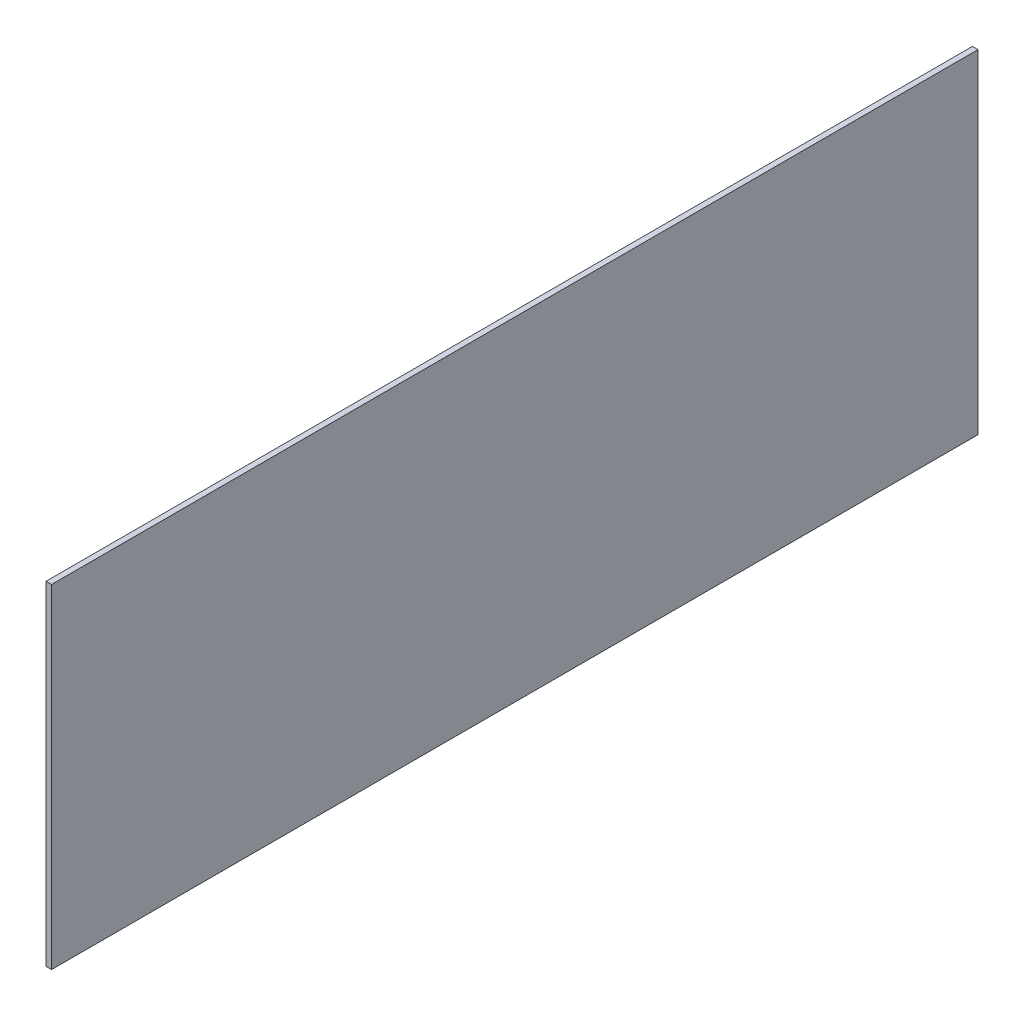
ISO-10303-21;
HEADER;
FILE_DESCRIPTION(('STEP AP214'),'2;1');
FILE_NAME('part.step','',(''),(''),'','','');
FILE_SCHEMA(('AUTOMOTIVE_DESIGN { 1 0 10303 214 1 1 1 1 }'));
ENDSEC;
DATA;
#1=APPLICATION_CONTEXT('core data for automotive mechanical design processes');
#2=APPLICATION_PROTOCOL_DEFINITION('international standard','automotive_design',2000,#1);
#3=PRODUCT_CONTEXT('',#1,'mechanical');
#4=PRODUCT('Part','Part','',(#3));
#5=PRODUCT_RELATED_PRODUCT_CATEGORY('part','',(#4));
#6=PRODUCT_DEFINITION_FORMATION('','',#4);
#7=PRODUCT_DEFINITION_CONTEXT('part definition',#1,'design');
#8=PRODUCT_DEFINITION('design','',#6,#7);
#9=PRODUCT_DEFINITION_SHAPE('','',#8);
#10=(LENGTH_UNIT() NAMED_UNIT(*) SI_UNIT(.MILLI.,.METRE.));
#11=(NAMED_UNIT(*) PLANE_ANGLE_UNIT() SI_UNIT($,.RADIAN.));
#12=(NAMED_UNIT(*) SI_UNIT($,.STERADIAN.) SOLID_ANGLE_UNIT());
#13=UNCERTAINTY_MEASURE_WITH_UNIT(LENGTH_MEASURE(1.E-05),#10,'distance_accuracy_value','');
#14=(GEOMETRIC_REPRESENTATION_CONTEXT(3) GLOBAL_UNCERTAINTY_ASSIGNED_CONTEXT((#13)) GLOBAL_UNIT_ASSIGNED_CONTEXT((#10,
#11,#12)) REPRESENTATION_CONTEXT('',''));
#15=CARTESIAN_POINT('',(0.,0.,0.));
#16=DIRECTION('',(0.,0.,1.));
#17=DIRECTION('',(1.,0.,0.));
#18=AXIS2_PLACEMENT_3D('',#15,#16,#17);
#19=CARTESIAN_POINT('',(30.,0.,0.));
#20=DIRECTION('',(0.,0.,-1.));
#21=DIRECTION('',(-1.,0.,0.));
#22=AXIS2_PLACEMENT_3D('',#19,#20,#21);
#23=PLANE('',#22);
#24=DIRECTION('',(0.,-1.,0.));
#25=VECTOR('',#24,1.);
#26=CARTESIAN_POINT('',(0.,0.,0.));
#27=LINE('',#26,#25);
#28=CARTESIAN_POINT('',(0.,1800.00000000001,0.));
#29=VERTEX_POINT('',#28);
#30=CARTESIAN_POINT('',(0.,0.,0.));
#31=VERTEX_POINT('',#30);
#32=EDGE_CURVE('E96',#29,#31,#27,.T.);
#33=ORIENTED_EDGE('',*,*,#32,.T.);
#34=DIRECTION('',(-1.,0.,0.));
#35=VECTOR('',#34,1.);
#36=CARTESIAN_POINT('',(30.,0.,0.));
#37=LINE('',#36,#35);
#38=CARTESIAN_POINT('',(30.,0.,0.));
#39=VERTEX_POINT('',#38);
#40=EDGE_CURVE('E11',#39,#31,#37,.T.);
#41=ORIENTED_EDGE('',*,*,#40,.F.);
#42=DIRECTION('',(0.,-1.,0.));
#43=VECTOR('',#42,1.);
#44=CARTESIAN_POINT('',(30.,0.,0.));
#45=LINE('',#44,#43);
#46=CARTESIAN_POINT('',(30.,1800.00000000001,0.));
#47=VERTEX_POINT('',#46);
#48=EDGE_CURVE('E84',#47,#39,#45,.T.);
#49=ORIENTED_EDGE('',*,*,#48,.F.);
#50=DIRECTION('',(-1.,0.,0.));
#51=VECTOR('',#50,1.);
#52=CARTESIAN_POINT('',(30.,1800.00000000001,0.));
#53=LINE('',#52,#51);
#54=EDGE_CURVE('E92',#47,#29,#53,.T.);
#55=ORIENTED_EDGE('',*,*,#54,.T.);
#56=EDGE_LOOP('',(#33,#41,#49,#55));
#57=FACE_BOUND('',#56,.T.);
#58=ADVANCED_FACE('F33',(#57),#23,.F.);
#59=CARTESIAN_POINT('',(30.,0.,0.));
#60=DIRECTION('',(0.,1.,0.));
#61=DIRECTION('',(0.,0.,1.));
#62=AXIS2_PLACEMENT_3D('',#59,#60,#61);
#63=PLANE('',#62);
#64=DIRECTION('',(0.,0.,-1.));
#65=VECTOR('',#64,1.);
#66=CARTESIAN_POINT('',(0.,0.,0.));
#67=LINE('',#66,#65);
#68=CARTESIAN_POINT('',(0.,0.,-5000.));
#69=VERTEX_POINT('',#68);
#70=EDGE_CURVE('E88',#31,#69,#67,.T.);
#71=ORIENTED_EDGE('',*,*,#70,.T.);
#72=DIRECTION('',(-1.,0.,0.));
#73=VECTOR('',#72,1.);
#74=CARTESIAN_POINT('',(30.,0.,-5000.));
#75=LINE('',#74,#73);
#76=CARTESIAN_POINT('',(30.,0.,-5000.));
#77=VERTEX_POINT('',#76);
#78=EDGE_CURVE('E41',#77,#69,#75,.T.);
#79=ORIENTED_EDGE('',*,*,#78,.F.);
#80=DIRECTION('',(0.,0.,-1.));
#81=VECTOR('',#80,1.);
#82=CARTESIAN_POINT('',(30.,0.,0.));
#83=LINE('',#82,#81);
#84=EDGE_CURVE('E79',#39,#77,#83,.T.);
#85=ORIENTED_EDGE('',*,*,#84,.F.);
#86=ORIENTED_EDGE('',*,*,#40,.T.);
#87=EDGE_LOOP('',(#71,#79,#85,#86));
#88=FACE_BOUND('',#87,.T.);
#89=ADVANCED_FACE('F87',(#88),#63,.F.);
#90=CARTESIAN_POINT('',(30.,0.,-5000.));
#91=DIRECTION('',(0.,0.,1.));
#92=DIRECTION('',(1.,0.,0.));
#93=AXIS2_PLACEMENT_3D('',#90,#91,#92);
#94=PLANE('',#93);
#95=DIRECTION('',(0.,1.,0.));
#96=VECTOR('',#95,1.);
#97=CARTESIAN_POINT('',(0.,0.,-5000.));
#98=LINE('',#97,#96);
#99=CARTESIAN_POINT('',(0.,1800.00000000001,-5000.));
#100=VERTEX_POINT('',#99);
#101=EDGE_CURVE('E66',#69,#100,#98,.T.);
#102=ORIENTED_EDGE('',*,*,#101,.T.);
#103=DIRECTION('',(-1.,0.,0.));
#104=VECTOR('',#103,1.);
#105=CARTESIAN_POINT('',(30.,1800.00000000001,-5000.));
#106=LINE('',#105,#104);
#107=CARTESIAN_POINT('',(30.,1800.00000000001,-5000.));
#108=VERTEX_POINT('',#107);
#109=EDGE_CURVE('E89',#108,#100,#106,.T.);
#110=ORIENTED_EDGE('',*,*,#109,.F.);
#111=DIRECTION('',(0.,1.,0.));
#112=VECTOR('',#111,1.);
#113=CARTESIAN_POINT('',(30.,0.,-5000.));
#114=LINE('',#113,#112);
#115=EDGE_CURVE('E82',#77,#108,#114,.T.);
#116=ORIENTED_EDGE('',*,*,#115,.F.);
#117=ORIENTED_EDGE('',*,*,#78,.T.);
#118=EDGE_LOOP('',(#102,#110,#116,#117));
#119=FACE_BOUND('',#118,.T.);
#120=ADVANCED_FACE('F90',(#119),#94,.F.);
#121=CARTESIAN_POINT('',(30.,1800.00000000001,0.));
#122=DIRECTION('',(0.,-1.,0.));
#123=DIRECTION('',(0.,0.,-1.));
#124=AXIS2_PLACEMENT_3D('',#121,#122,#123);
#125=PLANE('',#124);
#126=DIRECTION('',(0.,0.,1.));
#127=VECTOR('',#126,1.);
#128=CARTESIAN_POINT('',(0.,1800.00000000001,0.));
#129=LINE('',#128,#127);
#130=EDGE_CURVE('E72',#100,#29,#129,.T.);
#131=ORIENTED_EDGE('',*,*,#130,.T.);
#132=ORIENTED_EDGE('',*,*,#54,.F.);
#133=DIRECTION('',(0.,0.,1.));
#134=VECTOR('',#133,1.);
#135=CARTESIAN_POINT('',(30.,1800.00000000001,0.));
#136=LINE('',#135,#134);
#137=EDGE_CURVE('E49',#108,#47,#136,.T.);
#138=ORIENTED_EDGE('',*,*,#137,.F.);
#139=ORIENTED_EDGE('',*,*,#109,.T.);
#140=EDGE_LOOP('',(#131,#132,#138,#139));
#141=FACE_BOUND('',#140,.T.);
#142=ADVANCED_FACE('F103',(#141),#125,.F.);
#143=CARTESIAN_POINT('',(30.,0.,0.));
#144=DIRECTION('',(-1.,0.,0.));
#145=DIRECTION('',(0.,0.,1.));
#146=AXIS2_PLACEMENT_3D('',#143,#144,#145);
#147=PLANE('',#146);
#148=ORIENTED_EDGE('',*,*,#48,.T.);
#149=ORIENTED_EDGE('',*,*,#84,.T.);
#150=ORIENTED_EDGE('',*,*,#115,.T.);
#151=ORIENTED_EDGE('',*,*,#137,.T.);
#152=EDGE_LOOP('',(#148,#149,#150,#151));
#153=FACE_BOUND('',#152,.T.);
#154=ADVANCED_FACE('F80',(#153),#147,.F.);
#155=CARTESIAN_POINT('',(0.,0.,0.));
#156=DIRECTION('',(-1.,0.,0.));
#157=DIRECTION('',(0.,0.,1.));
#158=AXIS2_PLACEMENT_3D('',#155,#156,#157);
#159=PLANE('',#158);
#160=ORIENTED_EDGE('',*,*,#32,.F.);
#161=ORIENTED_EDGE('',*,*,#130,.F.);
#162=ORIENTED_EDGE('',*,*,#101,.F.);
#163=ORIENTED_EDGE('',*,*,#70,.F.);
#164=EDGE_LOOP('',(#160,#161,#162,#163));
#165=FACE_BOUND('',#164,.T.);
#166=ADVANCED_FACE('F106',(#165),#159,.T.);
#167=CLOSED_SHELL('',(#58,#89,#120,#142,#154,#166));
#168=MANIFOLD_SOLID_BREP('B2',#167);
#169=ADVANCED_BREP_SHAPE_REPRESENTATION('',(#18,#168),#14);
#170=SHAPE_DEFINITION_REPRESENTATION(#9,#169);
ENDSEC;
END-ISO-10303-21;
